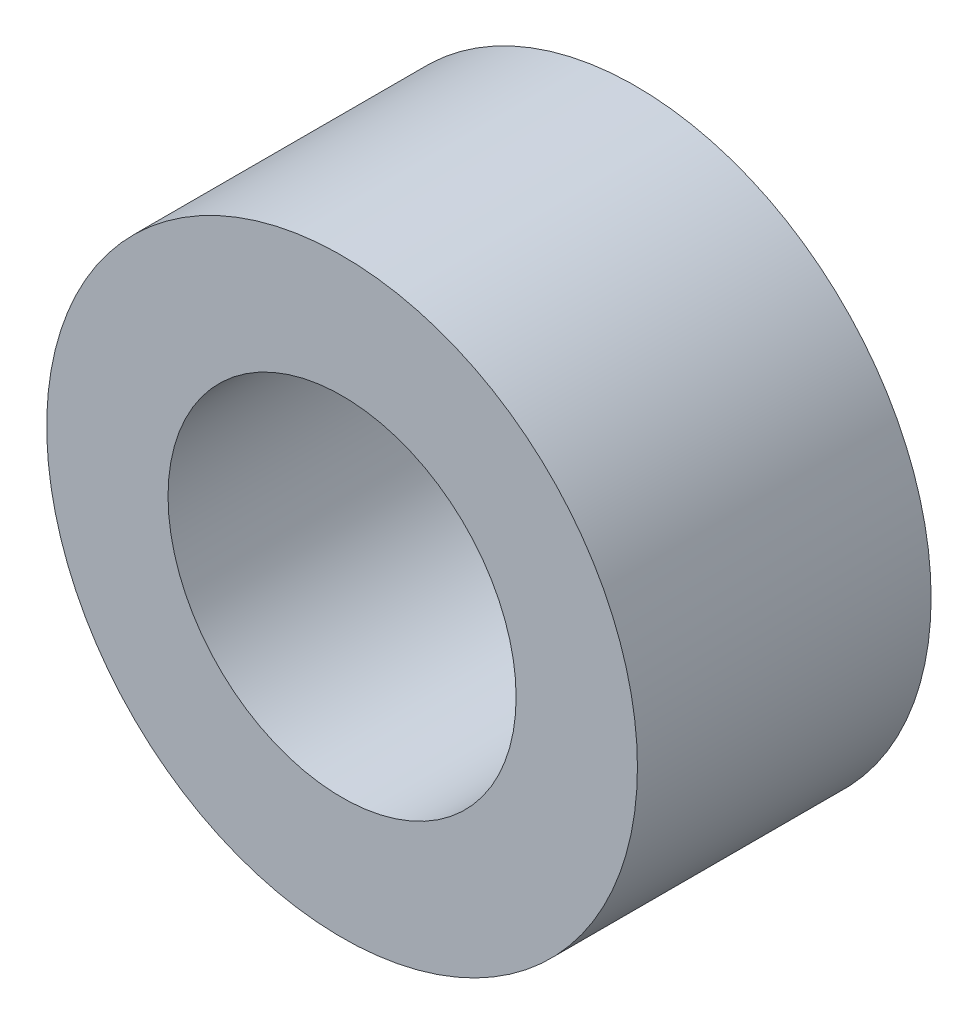
ISO-10303-21;
HEADER;
FILE_DESCRIPTION(('STEP AP214'),'2;1');
FILE_NAME('part.step','',(''),(''),'','','');
FILE_SCHEMA(('AUTOMOTIVE_DESIGN { 1 0 10303 214 1 1 1 1 }'));
ENDSEC;
DATA;
#1=APPLICATION_CONTEXT('core data for automotive mechanical design processes');
#2=APPLICATION_PROTOCOL_DEFINITION('international standard','automotive_design',2000,#1);
#3=PRODUCT_CONTEXT('',#1,'mechanical');
#4=PRODUCT('Part','Part','',(#3));
#5=PRODUCT_RELATED_PRODUCT_CATEGORY('part','',(#4));
#6=PRODUCT_DEFINITION_FORMATION('','',#4);
#7=PRODUCT_DEFINITION_CONTEXT('part definition',#1,'design');
#8=PRODUCT_DEFINITION('design','',#6,#7);
#9=PRODUCT_DEFINITION_SHAPE('','',#8);
#10=(LENGTH_UNIT() NAMED_UNIT(*) SI_UNIT(.MILLI.,.METRE.));
#11=(NAMED_UNIT(*) PLANE_ANGLE_UNIT() SI_UNIT($,.RADIAN.));
#12=(NAMED_UNIT(*) SI_UNIT($,.STERADIAN.) SOLID_ANGLE_UNIT());
#13=UNCERTAINTY_MEASURE_WITH_UNIT(LENGTH_MEASURE(1.E-05),#10,'distance_accuracy_value','');
#14=(GEOMETRIC_REPRESENTATION_CONTEXT(3) GLOBAL_UNCERTAINTY_ASSIGNED_CONTEXT((#13)) GLOBAL_UNIT_ASSIGNED_CONTEXT((#10,
#11,#12)) REPRESENTATION_CONTEXT('',''));
#15=CARTESIAN_POINT('',(0.,0.,0.));
#16=DIRECTION('',(0.,0.,1.));
#17=DIRECTION('',(1.,0.,0.));
#18=AXIS2_PLACEMENT_3D('',#15,#16,#17);
#19=CARTESIAN_POINT('',(0.,0.,0.));
#20=DIRECTION('',(0.,0.,1.));
#21=DIRECTION('',(1.,0.,0.));
#22=AXIS2_PLACEMENT_3D('',#19,#20,#21);
#23=CYLINDRICAL_SURFACE('',#22,6.54812);
#24=CARTESIAN_POINT('',(0.,0.,0.));
#25=DIRECTION('',(0.,0.,1.));
#26=DIRECTION('',(1.,0.,0.));
#27=AXIS2_PLACEMENT_3D('',#24,#25,#26);
#28=CIRCLE('',#27,6.54812);
#29=CARTESIAN_POINT('',(6.54812,0.,0.));
#30=VERTEX_POINT('',#29);
#31=EDGE_CURVE('E27',#30,#30,#28,.T.);
#32=ORIENTED_EDGE('',*,*,#31,.F.);
#33=EDGE_LOOP('',(#32));
#34=FACE_BOUND('',#33,.T.);
#35=CARTESIAN_POINT('',(0.,0.,11.049));
#36=DIRECTION('',(0.,0.,1.));
#37=DIRECTION('',(1.,0.,0.));
#38=AXIS2_PLACEMENT_3D('',#35,#36,#37);
#39=CIRCLE('',#38,6.54812);
#40=CARTESIAN_POINT('',(6.54812,0.,11.049));
#41=VERTEX_POINT('',#40);
#42=EDGE_CURVE('E18',#41,#41,#39,.T.);
#43=ORIENTED_EDGE('',*,*,#42,.T.);
#44=EDGE_LOOP('',(#43));
#45=FACE_BOUND('',#44,.T.);
#46=ADVANCED_FACE('F15',(#34,#45),#23,.F.);
#47=CARTESIAN_POINT('',(0.,0.,11.049));
#48=DIRECTION('',(0.,0.,-1.));
#49=DIRECTION('',(-1.,0.,0.));
#50=AXIS2_PLACEMENT_3D('',#47,#48,#49);
#51=PLANE('',#50);
#52=ORIENTED_EDGE('',*,*,#42,.F.);
#53=EDGE_LOOP('',(#52));
#54=FACE_BOUND('',#53,.T.);
#55=CARTESIAN_POINT('',(0.,0.,11.049));
#56=DIRECTION('',(0.,0.,1.));
#57=DIRECTION('',(1.,0.,0.));
#58=AXIS2_PLACEMENT_3D('',#55,#56,#57);
#59=CIRCLE('',#58,11.1125);
#60=CARTESIAN_POINT('',(11.1125,0.,11.049));
#61=VERTEX_POINT('',#60);
#62=EDGE_CURVE('E22',#61,#61,#59,.F.);
#63=ORIENTED_EDGE('',*,*,#62,.F.);
#64=EDGE_LOOP('',(#63));
#65=FACE_BOUND('',#64,.T.);
#66=ADVANCED_FACE('F36',(#54,#65),#51,.F.);
#67=CARTESIAN_POINT('',(0.,0.,0.));
#68=DIRECTION('',(0.,0.,-1.));
#69=DIRECTION('',(-1.,0.,0.));
#70=AXIS2_PLACEMENT_3D('',#67,#68,#69);
#71=PLANE('',#70);
#72=ORIENTED_EDGE('',*,*,#31,.T.);
#73=EDGE_LOOP('',(#72));
#74=FACE_BOUND('',#73,.T.);
#75=CARTESIAN_POINT('',(0.,0.,0.));
#76=DIRECTION('',(0.,0.,1.));
#77=DIRECTION('',(1.,0.,0.));
#78=AXIS2_PLACEMENT_3D('',#75,#76,#77);
#79=CIRCLE('',#78,11.1125);
#80=CARTESIAN_POINT('',(11.1125,0.,0.));
#81=VERTEX_POINT('',#80);
#82=EDGE_CURVE('E10',#81,#81,#79,.T.);
#83=ORIENTED_EDGE('',*,*,#82,.F.);
#84=EDGE_LOOP('',(#83));
#85=FACE_BOUND('',#84,.T.);
#86=ADVANCED_FACE('F39',(#74,#85),#71,.T.);
#87=CARTESIAN_POINT('',(0.,0.,0.));
#88=DIRECTION('',(0.,0.,1.));
#89=DIRECTION('',(1.,0.,0.));
#90=AXIS2_PLACEMENT_3D('',#87,#88,#89);
#91=CYLINDRICAL_SURFACE('',#90,11.1125);
#92=ORIENTED_EDGE('',*,*,#82,.T.);
#93=EDGE_LOOP('',(#92));
#94=FACE_BOUND('',#93,.T.);
#95=ORIENTED_EDGE('',*,*,#62,.T.);
#96=EDGE_LOOP('',(#95));
#97=FACE_BOUND('',#96,.T.);
#98=ADVANCED_FACE('F42',(#94,#97),#91,.T.);
#99=CLOSED_SHELL('',(#46,#66,#86,#98));
#100=MANIFOLD_SOLID_BREP('B1',#99);
#101=ADVANCED_BREP_SHAPE_REPRESENTATION('',(#18,#100),#14);
#102=SHAPE_DEFINITION_REPRESENTATION(#9,#101);
ENDSEC;
END-ISO-10303-21;
